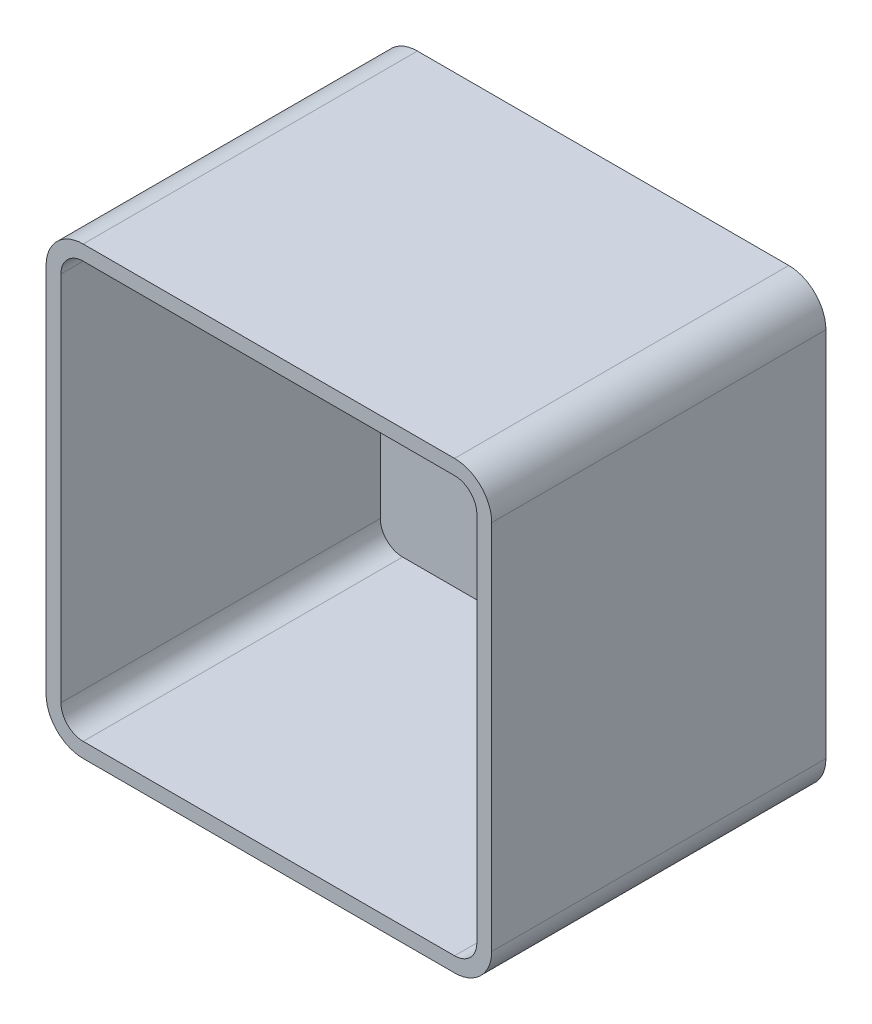
ISO-10303-21;
HEADER;
FILE_DESCRIPTION(('STEP AP214'),'2;1');
FILE_NAME('part.step','',(''),(''),'','','');
FILE_SCHEMA(('AUTOMOTIVE_DESIGN { 1 0 10303 214 1 1 1 1 }'));
ENDSEC;
DATA;
#1=APPLICATION_CONTEXT('core data for automotive mechanical design processes');
#2=APPLICATION_PROTOCOL_DEFINITION('international standard','automotive_design',2000,#1);
#3=PRODUCT_CONTEXT('',#1,'mechanical');
#4=PRODUCT('Part','Part','',(#3));
#5=PRODUCT_RELATED_PRODUCT_CATEGORY('part','',(#4));
#6=PRODUCT_DEFINITION_FORMATION('','',#4);
#7=PRODUCT_DEFINITION_CONTEXT('part definition',#1,'design');
#8=PRODUCT_DEFINITION('design','',#6,#7);
#9=PRODUCT_DEFINITION_SHAPE('','',#8);
#10=(LENGTH_UNIT() NAMED_UNIT(*) SI_UNIT(.MILLI.,.METRE.));
#11=(NAMED_UNIT(*) PLANE_ANGLE_UNIT() SI_UNIT($,.RADIAN.));
#12=(NAMED_UNIT(*) SI_UNIT($,.STERADIAN.) SOLID_ANGLE_UNIT());
#13=UNCERTAINTY_MEASURE_WITH_UNIT(LENGTH_MEASURE(1.E-05),#10,'distance_accuracy_value','');
#14=(GEOMETRIC_REPRESENTATION_CONTEXT(3) GLOBAL_UNCERTAINTY_ASSIGNED_CONTEXT((#13)) GLOBAL_UNIT_ASSIGNED_CONTEXT((#10,
#11,#12)) REPRESENTATION_CONTEXT('',''));
#15=CARTESIAN_POINT('',(0.,0.,0.));
#16=DIRECTION('',(0.,0.,1.));
#17=DIRECTION('',(1.,0.,0.));
#18=AXIS2_PLACEMENT_3D('',#15,#16,#17);
#19=CARTESIAN_POINT('',(0.,0.,90.));
#20=DIRECTION('',(1.,0.,0.));
#21=DIRECTION('',(0.,1.,0.));
#22=AXIS2_PLACEMENT_3D('',#19,#20,#21);
#23=PLANE('',#22);
#24=DIRECTION('',(0.,-1.,0.));
#25=VECTOR('',#24,1.);
#26=CARTESIAN_POINT('',(0.,0.,0.));
#27=LINE('',#26,#25);
#28=CARTESIAN_POINT('',(0.,110.,0.));
#29=VERTEX_POINT('',#28);
#30=CARTESIAN_POINT('',(0.,10.,0.));
#31=VERTEX_POINT('',#30);
#32=EDGE_CURVE('E199',#29,#31,#27,.T.);
#33=ORIENTED_EDGE('',*,*,#32,.T.);
#34=DIRECTION('',(0.,0.,-1.));
#35=VECTOR('',#34,1.);
#36=CARTESIAN_POINT('',(0.,10.,90.));
#37=LINE('',#36,#35);
#38=CARTESIAN_POINT('',(0.,10.,90.));
#39=VERTEX_POINT('',#38);
#40=EDGE_CURVE('E267',#31,#39,#37,.F.);
#41=ORIENTED_EDGE('',*,*,#40,.T.);
#42=DIRECTION('',(0.,-1.,0.));
#43=VECTOR('',#42,1.);
#44=CARTESIAN_POINT('',(0.,0.,90.));
#45=LINE('',#44,#43);
#46=CARTESIAN_POINT('',(0.,110.,90.));
#47=VERTEX_POINT('',#46);
#48=EDGE_CURVE('E217',#47,#39,#45,.T.);
#49=ORIENTED_EDGE('',*,*,#48,.F.);
#50=DIRECTION('',(0.,0.,-1.));
#51=VECTOR('',#50,1.);
#52=CARTESIAN_POINT('',(0.,110.,90.));
#53=LINE('',#52,#51);
#54=EDGE_CURVE('E264',#47,#29,#53,.T.);
#55=ORIENTED_EDGE('',*,*,#54,.T.);
#56=EDGE_LOOP('',(#33,#41,#49,#55));
#57=FACE_BOUND('',#56,.T.);
#58=ADVANCED_FACE('F39',(#57),#23,.F.);
#59=CARTESIAN_POINT('',(0.,0.,90.));
#60=DIRECTION('',(0.,1.,0.));
#61=DIRECTION('',(0.,0.,1.));
#62=AXIS2_PLACEMENT_3D('',#59,#60,#61);
#63=PLANE('',#62);
#64=DIRECTION('',(1.,0.,0.));
#65=VECTOR('',#64,1.);
#66=CARTESIAN_POINT('',(0.,0.,0.));
#67=LINE('',#66,#65);
#68=CARTESIAN_POINT('',(9.99999999999999,0.,0.));
#69=VERTEX_POINT('',#68);
#70=CARTESIAN_POINT('',(110.,0.,0.));
#71=VERTEX_POINT('',#70);
#72=EDGE_CURVE('E232',#69,#71,#67,.T.);
#73=ORIENTED_EDGE('',*,*,#72,.T.);
#74=DIRECTION('',(0.,0.,-1.));
#75=VECTOR('',#74,1.);
#76=CARTESIAN_POINT('',(110.,0.,90.));
#77=LINE('',#76,#75);
#78=CARTESIAN_POINT('',(110.,0.,90.));
#79=VERTEX_POINT('',#78);
#80=EDGE_CURVE('E254',#71,#79,#77,.F.);
#81=ORIENTED_EDGE('',*,*,#80,.T.);
#82=DIRECTION('',(1.,0.,0.));
#83=VECTOR('',#82,1.);
#84=CARTESIAN_POINT('',(0.,0.,90.));
#85=LINE('',#84,#83);
#86=CARTESIAN_POINT('',(9.99999999999999,0.,90.));
#87=VERTEX_POINT('',#86);
#88=EDGE_CURVE('E220',#87,#79,#85,.T.);
#89=ORIENTED_EDGE('',*,*,#88,.F.);
#90=DIRECTION('',(0.,0.,-1.));
#91=VECTOR('',#90,1.);
#92=CARTESIAN_POINT('',(9.99999999999999,0.,90.));
#93=LINE('',#92,#91);
#94=EDGE_CURVE('E251',#87,#69,#93,.T.);
#95=ORIENTED_EDGE('',*,*,#94,.T.);
#96=EDGE_LOOP('',(#73,#81,#89,#95));
#97=FACE_BOUND('',#96,.T.);
#98=ADVANCED_FACE('F283',(#97),#63,.F.);
#99=CARTESIAN_POINT('',(120.,0.,90.));
#100=DIRECTION('',(-1.,0.,0.));
#101=DIRECTION('',(0.,-1.,0.));
#102=AXIS2_PLACEMENT_3D('',#99,#100,#101);
#103=PLANE('',#102);
#104=DIRECTION('',(0.,1.,0.));
#105=VECTOR('',#104,1.);
#106=CARTESIAN_POINT('',(120.,0.,90.));
#107=LINE('',#106,#105);
#108=CARTESIAN_POINT('',(120.,10.,90.));
#109=VERTEX_POINT('',#108);
#110=CARTESIAN_POINT('',(120.,110.,90.));
#111=VERTEX_POINT('',#110);
#112=EDGE_CURVE('E224',#109,#111,#107,.T.);
#113=ORIENTED_EDGE('',*,*,#112,.F.);
#114=DIRECTION('',(0.,0.,-1.));
#115=VECTOR('',#114,1.);
#116=CARTESIAN_POINT('',(120.,10.,90.));
#117=LINE('',#116,#115);
#118=CARTESIAN_POINT('',(120.,10.,0.));
#119=VERTEX_POINT('',#118);
#120=EDGE_CURVE('E240',#109,#119,#117,.T.);
#121=ORIENTED_EDGE('',*,*,#120,.T.);
#122=DIRECTION('',(0.,1.,0.));
#123=VECTOR('',#122,1.);
#124=CARTESIAN_POINT('',(120.,0.,0.));
#125=LINE('',#124,#123);
#126=CARTESIAN_POINT('',(120.,110.,0.));
#127=VERTEX_POINT('',#126);
#128=EDGE_CURVE('E235',#119,#127,#125,.T.);
#129=ORIENTED_EDGE('',*,*,#128,.T.);
#130=DIRECTION('',(0.,0.,-1.));
#131=VECTOR('',#130,1.);
#132=CARTESIAN_POINT('',(120.,110.,90.));
#133=LINE('',#132,#131);
#134=EDGE_CURVE('E229',#127,#111,#133,.F.);
#135=ORIENTED_EDGE('',*,*,#134,.T.);
#136=EDGE_LOOP('',(#113,#121,#129,#135));
#137=FACE_BOUND('',#136,.T.);
#138=ADVANCED_FACE('F294',(#137),#103,.F.);
#139=CARTESIAN_POINT('',(0.,120.,90.));
#140=DIRECTION('',(0.,-1.,0.));
#141=DIRECTION('',(0.,0.,-1.));
#142=AXIS2_PLACEMENT_3D('',#139,#140,#141);
#143=PLANE('',#142);
#144=DIRECTION('',(-1.,0.,0.));
#145=VECTOR('',#144,1.);
#146=CARTESIAN_POINT('',(0.,120.,90.));
#147=LINE('',#146,#145);
#148=CARTESIAN_POINT('',(110.,120.,90.));
#149=VERTEX_POINT('',#148);
#150=CARTESIAN_POINT('',(9.99999999999998,120.,90.));
#151=VERTEX_POINT('',#150);
#152=EDGE_CURVE('E227',#149,#151,#147,.T.);
#153=ORIENTED_EDGE('',*,*,#152,.F.);
#154=DIRECTION('',(0.,0.,-1.));
#155=VECTOR('',#154,1.);
#156=CARTESIAN_POINT('',(110.,120.,90.));
#157=LINE('',#156,#155);
#158=CARTESIAN_POINT('',(110.,120.,0.));
#159=VERTEX_POINT('',#158);
#160=EDGE_CURVE('E11',#149,#159,#157,.T.);
#161=ORIENTED_EDGE('',*,*,#160,.T.);
#162=DIRECTION('',(-1.,0.,0.));
#163=VECTOR('',#162,1.);
#164=CARTESIAN_POINT('',(0.,120.,0.));
#165=LINE('',#164,#163);
#166=CARTESIAN_POINT('',(9.99999999999998,120.,0.));
#167=VERTEX_POINT('',#166);
#168=EDGE_CURVE('E221',#159,#167,#165,.T.);
#169=ORIENTED_EDGE('',*,*,#168,.T.);
#170=DIRECTION('',(0.,0.,-1.));
#171=VECTOR('',#170,1.);
#172=CARTESIAN_POINT('',(9.99999999999999,120.,90.));
#173=LINE('',#172,#171);
#174=EDGE_CURVE('E47',#167,#151,#173,.F.);
#175=ORIENTED_EDGE('',*,*,#174,.T.);
#176=EDGE_LOOP('',(#153,#161,#169,#175));
#177=FACE_BOUND('',#176,.T.);
#178=ADVANCED_FACE('F301',(#177),#143,.F.);
#179=CARTESIAN_POINT('',(0.,0.,90.));
#180=DIRECTION('',(0.,0.,-1.));
#181=DIRECTION('',(-1.,0.,0.));
#182=AXIS2_PLACEMENT_3D('',#179,#180,#181);
#183=PLANE('',#182);
#184=DIRECTION('',(1.,0.,0.));
#185=VECTOR('',#184,1.);
#186=CARTESIAN_POINT('',(0.,4.,90.));
#187=LINE('',#186,#185);
#188=CARTESIAN_POINT('',(9.99999999999999,4.,90.));
#189=VERTEX_POINT('',#188);
#190=CARTESIAN_POINT('',(110.,4.,90.));
#191=VERTEX_POINT('',#190);
#192=EDGE_CURVE('E180',#189,#191,#187,.T.);
#193=ORIENTED_EDGE('',*,*,#192,.F.);
#194=CARTESIAN_POINT('',(9.99999999999999,10.,90.));
#195=DIRECTION('',(0.,0.,-1.));
#196=DIRECTION('',(-1.,0.,0.));
#197=AXIS2_PLACEMENT_3D('',#194,#195,#196);
#198=CIRCLE('',#197,6.);
#199=CARTESIAN_POINT('',(4.,10.,90.));
#200=VERTEX_POINT('',#199);
#201=EDGE_CURVE('E205',#200,#189,#198,.F.);
#202=ORIENTED_EDGE('',*,*,#201,.F.);
#203=DIRECTION('',(0.,-1.,0.));
#204=VECTOR('',#203,1.);
#205=CARTESIAN_POINT('',(4.,0.,90.));
#206=LINE('',#205,#204);
#207=CARTESIAN_POINT('',(3.99999999999999,110.,90.));
#208=VERTEX_POINT('',#207);
#209=EDGE_CURVE('E54',#208,#200,#206,.T.);
#210=ORIENTED_EDGE('',*,*,#209,.F.);
#211=CARTESIAN_POINT('',(9.99999999999999,110.,90.));
#212=DIRECTION('',(0.,0.,-1.));
#213=DIRECTION('',(-1.,0.,0.));
#214=AXIS2_PLACEMENT_3D('',#211,#212,#213);
#215=CIRCLE('',#214,6.);
#216=CARTESIAN_POINT('',(9.99999999999998,116.,90.));
#217=VERTEX_POINT('',#216);
#218=EDGE_CURVE('E182',#217,#208,#215,.F.);
#219=ORIENTED_EDGE('',*,*,#218,.F.);
#220=DIRECTION('',(-1.,0.,0.));
#221=VECTOR('',#220,1.);
#222=CARTESIAN_POINT('',(0.,116.,90.));
#223=LINE('',#222,#221);
#224=CARTESIAN_POINT('',(110.,116.,90.));
#225=VERTEX_POINT('',#224);
#226=EDGE_CURVE('E195',#225,#217,#223,.T.);
#227=ORIENTED_EDGE('',*,*,#226,.F.);
#228=CARTESIAN_POINT('',(110.,110.,90.));
#229=DIRECTION('',(0.,0.,-1.));
#230=DIRECTION('',(-1.,0.,0.));
#231=AXIS2_PLACEMENT_3D('',#228,#229,#230);
#232=CIRCLE('',#231,6.);
#233=CARTESIAN_POINT('',(116.,110.,90.));
#234=VERTEX_POINT('',#233);
#235=EDGE_CURVE('E184',#234,#225,#232,.F.);
#236=ORIENTED_EDGE('',*,*,#235,.F.);
#237=DIRECTION('',(0.,1.,0.));
#238=VECTOR('',#237,1.);
#239=CARTESIAN_POINT('',(116.,0.,90.));
#240=LINE('',#239,#238);
#241=CARTESIAN_POINT('',(116.,10.,90.));
#242=VERTEX_POINT('',#241);
#243=EDGE_CURVE('E209',#242,#234,#240,.T.);
#244=ORIENTED_EDGE('',*,*,#243,.F.);
#245=CARTESIAN_POINT('',(110.,10.,90.));
#246=DIRECTION('',(0.,0.,-1.));
#247=DIRECTION('',(-1.,0.,0.));
#248=AXIS2_PLACEMENT_3D('',#245,#246,#247);
#249=CIRCLE('',#248,6.);
#250=EDGE_CURVE('E207',#191,#242,#249,.F.);
#251=ORIENTED_EDGE('',*,*,#250,.F.);
#252=EDGE_LOOP('',(#193,#202,#210,#219,#227,#236,#244,#251));
#253=FACE_BOUND('',#252,.T.);
#254=ORIENTED_EDGE('',*,*,#88,.T.);
#255=CARTESIAN_POINT('',(110.,10.,90.));
#256=DIRECTION('',(0.,0.,-1.));
#257=DIRECTION('',(-1.,0.,0.));
#258=AXIS2_PLACEMENT_3D('',#255,#256,#257);
#259=CIRCLE('',#258,10.);
#260=EDGE_CURVE('E262',#79,#109,#259,.F.);
#261=ORIENTED_EDGE('',*,*,#260,.T.);
#262=ORIENTED_EDGE('',*,*,#112,.T.);
#263=CARTESIAN_POINT('',(110.,110.,90.));
#264=DIRECTION('',(0.,0.,-1.));
#265=DIRECTION('',(-1.,0.,0.));
#266=AXIS2_PLACEMENT_3D('',#263,#264,#265);
#267=CIRCLE('',#266,10.);
#268=EDGE_CURVE('E258',#111,#149,#267,.F.);
#269=ORIENTED_EDGE('',*,*,#268,.T.);
#270=ORIENTED_EDGE('',*,*,#152,.T.);
#271=CARTESIAN_POINT('',(9.99999999999999,110.,90.));
#272=DIRECTION('',(0.,0.,-1.));
#273=DIRECTION('',(-1.,0.,0.));
#274=AXIS2_PLACEMENT_3D('',#271,#272,#273);
#275=CIRCLE('',#274,10.);
#276=EDGE_CURVE('E256',#151,#47,#275,.F.);
#277=ORIENTED_EDGE('',*,*,#276,.T.);
#278=ORIENTED_EDGE('',*,*,#48,.T.);
#279=CARTESIAN_POINT('',(9.99999999999999,10.,90.));
#280=DIRECTION('',(0.,0.,-1.));
#281=DIRECTION('',(-1.,0.,0.));
#282=AXIS2_PLACEMENT_3D('',#279,#280,#281);
#283=CIRCLE('',#282,10.);
#284=EDGE_CURVE('E260',#39,#87,#283,.F.);
#285=ORIENTED_EDGE('',*,*,#284,.T.);
#286=EDGE_LOOP('',(#254,#261,#262,#269,#270,#277,#278,#285));
#287=FACE_BOUND('',#286,.T.);
#288=ADVANCED_FACE('F276',(#253,#287),#183,.F.);
#289=CARTESIAN_POINT('',(0.,0.,0.));
#290=DIRECTION('',(0.,0.,-1.));
#291=DIRECTION('',(-1.,0.,0.));
#292=AXIS2_PLACEMENT_3D('',#289,#290,#291);
#293=PLANE('',#292);
#294=ORIENTED_EDGE('',*,*,#128,.F.);
#295=CARTESIAN_POINT('',(110.,10.,0.));
#296=DIRECTION('',(0.,0.,-1.));
#297=DIRECTION('',(-1.,0.,0.));
#298=AXIS2_PLACEMENT_3D('',#295,#296,#297);
#299=CIRCLE('',#298,10.);
#300=EDGE_CURVE('E249',#119,#71,#299,.T.);
#301=ORIENTED_EDGE('',*,*,#300,.T.);
#302=ORIENTED_EDGE('',*,*,#72,.F.);
#303=CARTESIAN_POINT('',(9.99999999999999,10.,0.));
#304=DIRECTION('',(0.,0.,-1.));
#305=DIRECTION('',(-1.,0.,0.));
#306=AXIS2_PLACEMENT_3D('',#303,#304,#305);
#307=CIRCLE('',#306,10.);
#308=EDGE_CURVE('E247',#69,#31,#307,.T.);
#309=ORIENTED_EDGE('',*,*,#308,.T.);
#310=ORIENTED_EDGE('',*,*,#32,.F.);
#311=CARTESIAN_POINT('',(9.99999999999999,110.,0.));
#312=DIRECTION('',(0.,0.,-1.));
#313=DIRECTION('',(-1.,0.,0.));
#314=AXIS2_PLACEMENT_3D('',#311,#312,#313);
#315=CIRCLE('',#314,10.);
#316=EDGE_CURVE('E243',#29,#167,#315,.T.);
#317=ORIENTED_EDGE('',*,*,#316,.T.);
#318=ORIENTED_EDGE('',*,*,#168,.F.);
#319=CARTESIAN_POINT('',(110.,110.,0.));
#320=DIRECTION('',(0.,0.,-1.));
#321=DIRECTION('',(-1.,0.,0.));
#322=AXIS2_PLACEMENT_3D('',#319,#320,#321);
#323=CIRCLE('',#322,10.);
#324=EDGE_CURVE('E245',#159,#127,#323,.T.);
#325=ORIENTED_EDGE('',*,*,#324,.T.);
#326=EDGE_LOOP('',(#294,#301,#302,#309,#310,#317,#318,#325));
#327=FACE_BOUND('',#326,.T.);
#328=ADVANCED_FACE('F287',(#327),#293,.T.);
#329=CARTESIAN_POINT('',(110.,10.,90.));
#330=DIRECTION('',(0.,0.,-1.));
#331=DIRECTION('',(-1.,0.,0.));
#332=AXIS2_PLACEMENT_3D('',#329,#330,#331);
#333=CYLINDRICAL_SURFACE('',#332,10.);
#334=ORIENTED_EDGE('',*,*,#260,.F.);
#335=ORIENTED_EDGE('',*,*,#80,.F.);
#336=ORIENTED_EDGE('',*,*,#300,.F.);
#337=ORIENTED_EDGE('',*,*,#120,.F.);
#338=EDGE_LOOP('',(#334,#335,#336,#337));
#339=FACE_BOUND('',#338,.T.);
#340=ADVANCED_FACE('F291',(#339),#333,.T.);
#341=CARTESIAN_POINT('',(9.99999999999999,10.,90.));
#342=DIRECTION('',(0.,0.,-1.));
#343=DIRECTION('',(-1.,0.,0.));
#344=AXIS2_PLACEMENT_3D('',#341,#342,#343);
#345=CYLINDRICAL_SURFACE('',#344,10.);
#346=ORIENTED_EDGE('',*,*,#284,.F.);
#347=ORIENTED_EDGE('',*,*,#40,.F.);
#348=ORIENTED_EDGE('',*,*,#308,.F.);
#349=ORIENTED_EDGE('',*,*,#94,.F.);
#350=EDGE_LOOP('',(#346,#347,#348,#349));
#351=FACE_BOUND('',#350,.T.);
#352=ADVANCED_FACE('F280',(#351),#345,.T.);
#353=CARTESIAN_POINT('',(110.,110.,90.));
#354=DIRECTION('',(0.,0.,-1.));
#355=DIRECTION('',(-1.,0.,0.));
#356=AXIS2_PLACEMENT_3D('',#353,#354,#355);
#357=CYLINDRICAL_SURFACE('',#356,10.);
#358=ORIENTED_EDGE('',*,*,#268,.F.);
#359=ORIENTED_EDGE('',*,*,#134,.F.);
#360=ORIENTED_EDGE('',*,*,#324,.F.);
#361=ORIENTED_EDGE('',*,*,#160,.F.);
#362=EDGE_LOOP('',(#358,#359,#360,#361));
#363=FACE_BOUND('',#362,.T.);
#364=ADVANCED_FACE('F299',(#363),#357,.T.);
#365=CARTESIAN_POINT('',(9.99999999999999,110.,90.));
#366=DIRECTION('',(0.,0.,-1.));
#367=DIRECTION('',(-1.,0.,0.));
#368=AXIS2_PLACEMENT_3D('',#365,#366,#367);
#369=CYLINDRICAL_SURFACE('',#368,10.);
#370=ORIENTED_EDGE('',*,*,#276,.F.);
#371=ORIENTED_EDGE('',*,*,#174,.F.);
#372=ORIENTED_EDGE('',*,*,#316,.F.);
#373=ORIENTED_EDGE('',*,*,#54,.F.);
#374=EDGE_LOOP('',(#370,#371,#372,#373));
#375=FACE_BOUND('',#374,.T.);
#376=ADVANCED_FACE('F41',(#375),#369,.T.);
#377=CARTESIAN_POINT('',(4.,0.,90.));
#378=DIRECTION('',(1.,0.,0.));
#379=DIRECTION('',(0.,1.,0.));
#380=AXIS2_PLACEMENT_3D('',#377,#378,#379);
#381=PLANE('',#380);
#382=DIRECTION('',(0.,-1.,0.));
#383=VECTOR('',#382,1.);
#384=CARTESIAN_POINT('',(4.,0.,4.));
#385=LINE('',#384,#383);
#386=CARTESIAN_POINT('',(3.99999999999999,110.,4.));
#387=VERTEX_POINT('',#386);
#388=CARTESIAN_POINT('',(4.,10.,4.));
#389=VERTEX_POINT('',#388);
#390=EDGE_CURVE('E176',#387,#389,#385,.T.);
#391=ORIENTED_EDGE('',*,*,#390,.F.);
#392=DIRECTION('',(0.,0.,1.));
#393=VECTOR('',#392,1.);
#394=CARTESIAN_POINT('',(3.99999999999999,110.,90.));
#395=LINE('',#394,#393);
#396=EDGE_CURVE('E211',#208,#387,#395,.F.);
#397=ORIENTED_EDGE('',*,*,#396,.F.);
#398=ORIENTED_EDGE('',*,*,#209,.T.);
#399=DIRECTION('',(0.,0.,1.));
#400=VECTOR('',#399,1.);
#401=CARTESIAN_POINT('',(4.,10.,90.));
#402=LINE('',#401,#400);
#403=EDGE_CURVE('E202',#389,#200,#402,.T.);
#404=ORIENTED_EDGE('',*,*,#403,.F.);
#405=EDGE_LOOP('',(#391,#397,#398,#404));
#406=FACE_BOUND('',#405,.T.);
#407=ADVANCED_FACE('F304',(#406),#381,.T.);
#408=CARTESIAN_POINT('',(0.,4.,90.));
#409=DIRECTION('',(0.,1.,0.));
#410=DIRECTION('',(0.,0.,1.));
#411=AXIS2_PLACEMENT_3D('',#408,#409,#410);
#412=PLANE('',#411);
#413=DIRECTION('',(1.,0.,0.));
#414=VECTOR('',#413,1.);
#415=CARTESIAN_POINT('',(0.,4.,4.));
#416=LINE('',#415,#414);
#417=CARTESIAN_POINT('',(9.99999999999999,4.,4.));
#418=VERTEX_POINT('',#417);
#419=CARTESIAN_POINT('',(110.,4.,4.));
#420=VERTEX_POINT('',#419);
#421=EDGE_CURVE('E169',#418,#420,#416,.T.);
#422=ORIENTED_EDGE('',*,*,#421,.F.);
#423=DIRECTION('',(0.,0.,1.));
#424=VECTOR('',#423,1.);
#425=CARTESIAN_POINT('',(9.99999999999999,4.,90.));
#426=LINE('',#425,#424);
#427=EDGE_CURVE('E165',#189,#418,#426,.F.);
#428=ORIENTED_EDGE('',*,*,#427,.F.);
#429=ORIENTED_EDGE('',*,*,#192,.T.);
#430=DIRECTION('',(0.,0.,1.));
#431=VECTOR('',#430,1.);
#432=CARTESIAN_POINT('',(110.,4.,90.));
#433=LINE('',#432,#431);
#434=EDGE_CURVE('E158',#420,#191,#433,.T.);
#435=ORIENTED_EDGE('',*,*,#434,.F.);
#436=EDGE_LOOP('',(#422,#428,#429,#435));
#437=FACE_BOUND('',#436,.T.);
#438=ADVANCED_FACE('F178',(#437),#412,.T.);
#439=CARTESIAN_POINT('',(116.,0.,90.));
#440=DIRECTION('',(-1.,0.,0.));
#441=DIRECTION('',(0.,-1.,0.));
#442=AXIS2_PLACEMENT_3D('',#439,#440,#441);
#443=PLANE('',#442);
#444=ORIENTED_EDGE('',*,*,#243,.T.);
#445=DIRECTION('',(0.,0.,1.));
#446=VECTOR('',#445,1.);
#447=CARTESIAN_POINT('',(116.,110.,90.));
#448=LINE('',#447,#446);
#449=CARTESIAN_POINT('',(116.,110.,4.));
#450=VERTEX_POINT('',#449);
#451=EDGE_CURVE('E193',#450,#234,#448,.T.);
#452=ORIENTED_EDGE('',*,*,#451,.F.);
#453=DIRECTION('',(0.,1.,0.));
#454=VECTOR('',#453,1.);
#455=CARTESIAN_POINT('',(116.,0.,4.));
#456=LINE('',#455,#454);
#457=CARTESIAN_POINT('',(116.,10.,4.));
#458=VERTEX_POINT('',#457);
#459=EDGE_CURVE('E175',#458,#450,#456,.T.);
#460=ORIENTED_EDGE('',*,*,#459,.F.);
#461=DIRECTION('',(0.,0.,1.));
#462=VECTOR('',#461,1.);
#463=CARTESIAN_POINT('',(116.,10.,90.));
#464=LINE('',#463,#462);
#465=EDGE_CURVE('E161',#242,#458,#464,.F.);
#466=ORIENTED_EDGE('',*,*,#465,.F.);
#467=EDGE_LOOP('',(#444,#452,#460,#466));
#468=FACE_BOUND('',#467,.T.);
#469=ADVANCED_FACE('F352',(#468),#443,.T.);
#470=CARTESIAN_POINT('',(0.,116.,90.));
#471=DIRECTION('',(0.,-1.,0.));
#472=DIRECTION('',(0.,0.,-1.));
#473=AXIS2_PLACEMENT_3D('',#470,#471,#472);
#474=PLANE('',#473);
#475=ORIENTED_EDGE('',*,*,#226,.T.);
#476=DIRECTION('',(0.,0.,-1.));
#477=VECTOR('',#476,1.);
#478=CARTESIAN_POINT('',(9.99999999999998,116.,90.));
#479=LINE('',#478,#477);
#480=CARTESIAN_POINT('',(9.99999999999998,116.,4.));
#481=VERTEX_POINT('',#480);
#482=EDGE_CURVE('E200',#481,#217,#479,.F.);
#483=ORIENTED_EDGE('',*,*,#482,.F.);
#484=DIRECTION('',(-1.,0.,0.));
#485=VECTOR('',#484,1.);
#486=CARTESIAN_POINT('',(0.,116.,4.));
#487=LINE('',#486,#485);
#488=CARTESIAN_POINT('',(110.,116.,4.));
#489=VERTEX_POINT('',#488);
#490=EDGE_CURVE('E204',#489,#481,#487,.T.);
#491=ORIENTED_EDGE('',*,*,#490,.F.);
#492=DIRECTION('',(0.,0.,-1.));
#493=VECTOR('',#492,1.);
#494=CARTESIAN_POINT('',(110.,116.,90.));
#495=LINE('',#494,#493);
#496=EDGE_CURVE('E196',#225,#489,#495,.T.);
#497=ORIENTED_EDGE('',*,*,#496,.F.);
#498=EDGE_LOOP('',(#475,#483,#491,#497));
#499=FACE_BOUND('',#498,.T.);
#500=ADVANCED_FACE('F361',(#499),#474,.T.);
#501=CARTESIAN_POINT('',(0.,0.,4.));
#502=DIRECTION('',(0.,0.,-1.));
#503=DIRECTION('',(-1.,0.,0.));
#504=AXIS2_PLACEMENT_3D('',#501,#502,#503);
#505=PLANE('',#504);
#506=ORIENTED_EDGE('',*,*,#459,.T.);
#507=CARTESIAN_POINT('',(110.,110.,4.));
#508=DIRECTION('',(0.,0.,-1.));
#509=DIRECTION('',(-1.,0.,0.));
#510=AXIS2_PLACEMENT_3D('',#507,#508,#509);
#511=CIRCLE('',#510,6.);
#512=EDGE_CURVE('E188',#489,#450,#511,.T.);
#513=ORIENTED_EDGE('',*,*,#512,.F.);
#514=ORIENTED_EDGE('',*,*,#490,.T.);
#515=CARTESIAN_POINT('',(9.99999999999999,110.,4.));
#516=DIRECTION('',(0.,0.,-1.));
#517=DIRECTION('',(-1.,0.,0.));
#518=AXIS2_PLACEMENT_3D('',#515,#516,#517);
#519=CIRCLE('',#518,6.);
#520=EDGE_CURVE('E192',#387,#481,#519,.T.);
#521=ORIENTED_EDGE('',*,*,#520,.F.);
#522=ORIENTED_EDGE('',*,*,#390,.T.);
#523=CARTESIAN_POINT('',(9.99999999999999,10.,4.));
#524=DIRECTION('',(0.,0.,-1.));
#525=DIRECTION('',(-1.,0.,0.));
#526=AXIS2_PLACEMENT_3D('',#523,#524,#525);
#527=CIRCLE('',#526,6.);
#528=EDGE_CURVE('E166',#418,#389,#527,.T.);
#529=ORIENTED_EDGE('',*,*,#528,.F.);
#530=ORIENTED_EDGE('',*,*,#421,.T.);
#531=CARTESIAN_POINT('',(110.,10.,4.));
#532=DIRECTION('',(0.,0.,-1.));
#533=DIRECTION('',(-1.,0.,0.));
#534=AXIS2_PLACEMENT_3D('',#531,#532,#533);
#535=CIRCLE('',#534,6.);
#536=EDGE_CURVE('E154',#458,#420,#535,.T.);
#537=ORIENTED_EDGE('',*,*,#536,.F.);
#538=EDGE_LOOP('',(#506,#513,#514,#521,#522,#529,#530,#537));
#539=FACE_BOUND('',#538,.T.);
#540=ADVANCED_FACE('F170',(#539),#505,.F.);
#541=CARTESIAN_POINT('',(110.,10.,90.));
#542=DIRECTION('',(0.,0.,-1.));
#543=DIRECTION('',(-1.,0.,0.));
#544=AXIS2_PLACEMENT_3D('',#541,#542,#543);
#545=CYLINDRICAL_SURFACE('',#544,6.);
#546=ORIENTED_EDGE('',*,*,#250,.T.);
#547=ORIENTED_EDGE('',*,*,#465,.T.);
#548=ORIENTED_EDGE('',*,*,#536,.T.);
#549=ORIENTED_EDGE('',*,*,#434,.T.);
#550=EDGE_LOOP('',(#546,#547,#548,#549));
#551=FACE_BOUND('',#550,.T.);
#552=ADVANCED_FACE('F156',(#551),#545,.F.);
#553=CARTESIAN_POINT('',(9.99999999999999,10.,90.));
#554=DIRECTION('',(0.,0.,-1.));
#555=DIRECTION('',(-1.,0.,0.));
#556=AXIS2_PLACEMENT_3D('',#553,#554,#555);
#557=CYLINDRICAL_SURFACE('',#556,6.);
#558=ORIENTED_EDGE('',*,*,#201,.T.);
#559=ORIENTED_EDGE('',*,*,#427,.T.);
#560=ORIENTED_EDGE('',*,*,#528,.T.);
#561=ORIENTED_EDGE('',*,*,#403,.T.);
#562=EDGE_LOOP('',(#558,#559,#560,#561));
#563=FACE_BOUND('',#562,.T.);
#564=ADVANCED_FACE('F388',(#563),#557,.F.);
#565=CARTESIAN_POINT('',(110.,110.,90.));
#566=DIRECTION('',(0.,0.,-1.));
#567=DIRECTION('',(-1.,0.,0.));
#568=AXIS2_PLACEMENT_3D('',#565,#566,#567);
#569=CYLINDRICAL_SURFACE('',#568,6.);
#570=ORIENTED_EDGE('',*,*,#235,.T.);
#571=ORIENTED_EDGE('',*,*,#496,.T.);
#572=ORIENTED_EDGE('',*,*,#512,.T.);
#573=ORIENTED_EDGE('',*,*,#451,.T.);
#574=EDGE_LOOP('',(#570,#571,#572,#573));
#575=FACE_BOUND('',#574,.T.);
#576=ADVANCED_FACE('F397',(#575),#569,.F.);
#577=CARTESIAN_POINT('',(9.99999999999999,110.,90.));
#578=DIRECTION('',(0.,0.,-1.));
#579=DIRECTION('',(-1.,0.,0.));
#580=AXIS2_PLACEMENT_3D('',#577,#578,#579);
#581=CYLINDRICAL_SURFACE('',#580,6.);
#582=ORIENTED_EDGE('',*,*,#218,.T.);
#583=ORIENTED_EDGE('',*,*,#396,.T.);
#584=ORIENTED_EDGE('',*,*,#520,.T.);
#585=ORIENTED_EDGE('',*,*,#482,.T.);
#586=EDGE_LOOP('',(#582,#583,#584,#585));
#587=FACE_BOUND('',#586,.T.);
#588=ADVANCED_FACE('F407',(#587),#581,.F.);
#589=CLOSED_SHELL('',(#58,#98,#138,#178,#288,#328,#340,#352,#364,#376,#407,#438,#469,#500,#540,
#552,#564,#576,#588));
#590=MANIFOLD_SOLID_BREP('B2',#589);
#591=ADVANCED_BREP_SHAPE_REPRESENTATION('',(#18,#590),#14);
#592=SHAPE_DEFINITION_REPRESENTATION(#9,#591);
ENDSEC;
END-ISO-10303-21;
